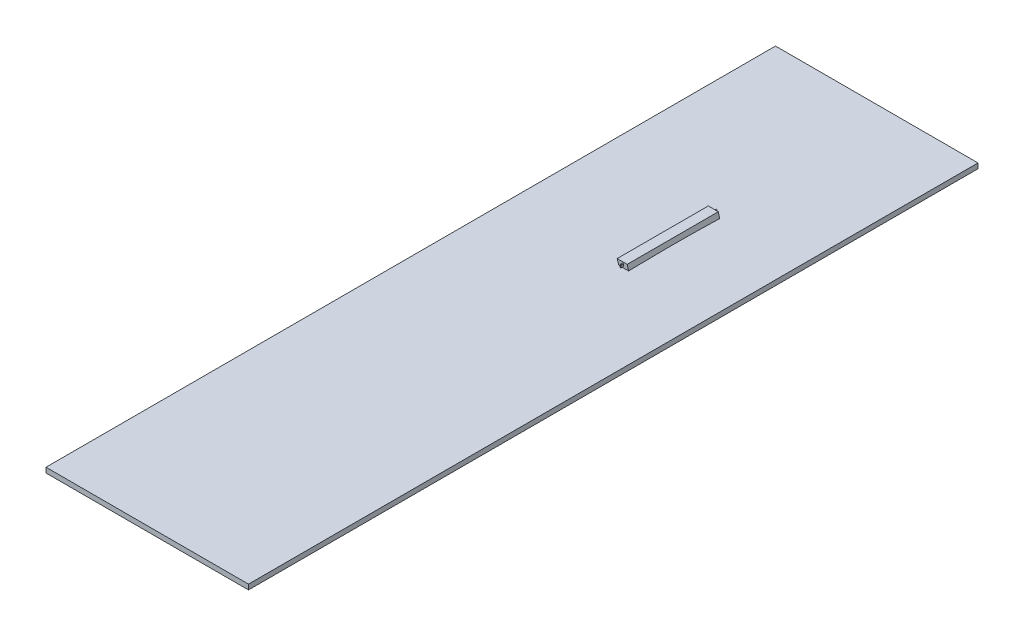
ISO-10303-21;
HEADER;
FILE_DESCRIPTION(('STEP AP214'),'2;1');
FILE_NAME('part.step','',(''),(''),'','','');
FILE_SCHEMA(('AUTOMOTIVE_DESIGN { 1 0 10303 214 1 1 1 1 }'));
ENDSEC;
DATA;
#1=APPLICATION_CONTEXT('core data for automotive mechanical design processes');
#2=APPLICATION_PROTOCOL_DEFINITION('international standard','automotive_design',2000,#1);
#3=PRODUCT_CONTEXT('',#1,'mechanical');
#4=PRODUCT('Part','Part','',(#3));
#5=PRODUCT_RELATED_PRODUCT_CATEGORY('part','',(#4));
#6=PRODUCT_DEFINITION_FORMATION('','',#4);
#7=PRODUCT_DEFINITION_CONTEXT('part definition',#1,'design');
#8=PRODUCT_DEFINITION('design','',#6,#7);
#9=PRODUCT_DEFINITION_SHAPE('','',#8);
#10=(LENGTH_UNIT() NAMED_UNIT(*) SI_UNIT(.MILLI.,.METRE.));
#11=(NAMED_UNIT(*) PLANE_ANGLE_UNIT() SI_UNIT($,.RADIAN.));
#12=(NAMED_UNIT(*) SI_UNIT($,.STERADIAN.) SOLID_ANGLE_UNIT());
#13=UNCERTAINTY_MEASURE_WITH_UNIT(LENGTH_MEASURE(1.E-05),#10,'distance_accuracy_value','');
#14=(GEOMETRIC_REPRESENTATION_CONTEXT(3) GLOBAL_UNCERTAINTY_ASSIGNED_CONTEXT((#13)) GLOBAL_UNIT_ASSIGNED_CONTEXT((#10,
#11,#12)) REPRESENTATION_CONTEXT('',''));
#15=CARTESIAN_POINT('',(0.,0.,0.));
#16=DIRECTION('',(0.,0.,1.));
#17=DIRECTION('',(1.,0.,0.));
#18=AXIS2_PLACEMENT_3D('',#15,#16,#17);
#19=CARTESIAN_POINT('',(0.,0.,-360.906787209581));
#20=DIRECTION('',(0.,0.,1.));
#21=DIRECTION('',(1.,0.,0.));
#22=AXIS2_PLACEMENT_3D('',#19,#20,#21);
#23=PLANE('',#22);
#24=DIRECTION('',(0.2647824909299,-0.964308162620724,0.));
#25=VECTOR('',#24,1.);
#26=CARTESIAN_POINT('',(38.8064860248671,394.0012038353,-360.906787209581));
#27=LINE('',#26,#25);
#28=CARTESIAN_POINT('',(54.3516519773393,337.387451299709,-360.906787209581));
#29=VERTEX_POINT('',#28);
#30=CARTESIAN_POINT('',(57.1851759921099,327.068074339287,-360.906787209581));
#31=VERTEX_POINT('',#30);
#32=EDGE_CURVE('E503',#29,#31,#27,.T.);
#33=ORIENTED_EDGE('',*,*,#32,.T.);
#34=DIRECTION('',(1.,0.,0.));
#35=VECTOR('',#34,1.);
#36=CARTESIAN_POINT('',(47.5638224982674,327.068074339287,-360.906787209581));
#37=LINE('',#36,#35);
#38=CARTESIAN_POINT('',(38.0650432552608,327.068074339287,-360.906787209581));
#39=VERTEX_POINT('',#38);
#40=EDGE_CURVE('E14',#31,#39,#37,.F.);
#41=ORIENTED_EDGE('',*,*,#40,.T.);
#42=CARTESIAN_POINT('',(79.5934517566759,140.935265317445,-360.906787209581));
#43=CARTESIAN_POINT('',(67.7143056578116,242.605545870488,-360.906787209581));
#44=CARTESIAN_POINT('',(33.8252863264388,339.461806899819,-360.906787209581));
#45=B_SPLINE_CURVE_WITH_KNOTS('',2,(#42,#43,#44),.UNSPECIFIED.,.F.,.F.,(3,3),(0.,1.),.UNSPECIFIED.);
#46=CARTESIAN_POINT('',(34.5483666432307,337.387451299709,-360.906787209581));
#47=VERTEX_POINT('',#46);
#48=EDGE_CURVE('E506',#39,#47,#45,.T.);
#49=ORIENTED_EDGE('',*,*,#48,.T.);
#50=DIRECTION('',(-1.,0.,0.));
#51=VECTOR('',#50,1.);
#52=CARTESIAN_POINT('',(0.,337.387451299709,-360.906787209581));
#53=LINE('',#52,#51);
#54=EDGE_CURVE('E511',#29,#47,#53,.T.);
#55=ORIENTED_EDGE('',*,*,#54,.F.);
#56=EDGE_LOOP('',(#33,#41,#49,#55));
#57=FACE_BOUND('',#56,.T.);
#58=DIRECTION('',(0.,1.,0.));
#59=VECTOR('',#58,1.);
#60=CARTESIAN_POINT('',(45.0654228732989,329.637204108034,-360.906787209581));
#61=LINE('',#60,#59);
#62=CARTESIAN_POINT('',(45.0654228732989,329.637204108034,-360.906787209581));
#63=VERTEX_POINT('',#62);
#64=CARTESIAN_POINT('',(45.0654228732989,334.637204108034,-360.906787209581));
#65=VERTEX_POINT('',#64);
#66=EDGE_CURVE('E454',#63,#65,#61,.T.);
#67=ORIENTED_EDGE('',*,*,#66,.F.);
#68=DIRECTION('',(-1.,0.,0.));
#69=VECTOR('',#68,1.);
#70=CARTESIAN_POINT('',(47.0654228732989,329.637204108034,-360.906787209581));
#71=LINE('',#70,#69);
#72=CARTESIAN_POINT('',(47.0654228732989,329.637204108034,-360.906787209581));
#73=VERTEX_POINT('',#72);
#74=EDGE_CURVE('E451',#73,#63,#71,.T.);
#75=ORIENTED_EDGE('',*,*,#74,.F.);
#76=DIRECTION('',(0.,-1.,0.));
#77=VECTOR('',#76,1.);
#78=CARTESIAN_POINT('',(47.0654228732989,329.637204108034,-360.906787209581));
#79=LINE('',#78,#77);
#80=CARTESIAN_POINT('',(47.0654228732989,334.637204108034,-360.906787209581));
#81=VERTEX_POINT('',#80);
#82=EDGE_CURVE('E364',#81,#73,#79,.T.);
#83=ORIENTED_EDGE('',*,*,#82,.F.);
#84=DIRECTION('',(1.,0.,0.));
#85=VECTOR('',#84,1.);
#86=CARTESIAN_POINT('',(47.0654228732989,334.637204108034,-360.906787209581));
#87=LINE('',#86,#85);
#88=EDGE_CURVE('E359',#65,#81,#87,.T.);
#89=ORIENTED_EDGE('',*,*,#88,.F.);
#90=EDGE_LOOP('',(#67,#75,#83,#89));
#91=FACE_BOUND('',#90,.T.);
#92=ADVANCED_FACE('F341',(#57,#91),#23,.F.);
#93=CARTESIAN_POINT('',(0.,0.,-180.906787209581));
#94=DIRECTION('',(0.,0.,1.));
#95=DIRECTION('',(1.,0.,0.));
#96=AXIS2_PLACEMENT_3D('',#93,#94,#95);
#97=PLANE('',#96);
#98=DIRECTION('',(-1.,0.,0.));
#99=VECTOR('',#98,1.);
#100=CARTESIAN_POINT('',(0.,337.387451299709,-180.906787209581));
#101=LINE('',#100,#99);
#102=CARTESIAN_POINT('',(54.3516519773393,337.387451299709,-180.906787209581));
#103=VERTEX_POINT('',#102);
#104=CARTESIAN_POINT('',(34.5483666432307,337.387451299709,-180.906787209581));
#105=VERTEX_POINT('',#104);
#106=EDGE_CURVE('E528',#103,#105,#101,.T.);
#107=ORIENTED_EDGE('',*,*,#106,.T.);
#108=CARTESIAN_POINT('',(79.5934517566759,140.935265317445,-180.906787209581));
#109=CARTESIAN_POINT('',(67.7143056578116,242.605545870488,-180.906787209581));
#110=CARTESIAN_POINT('',(33.8252863264388,339.461806899819,-180.906787209581));
#111=B_SPLINE_CURVE_WITH_KNOTS('',2,(#108,#109,#110),.UNSPECIFIED.,.F.,.F.,(3,3),(0.,1.),.UNSPECIFIED.);
#112=CARTESIAN_POINT('',(37.9482883061183,327.417085444205,-180.906787209581));
#113=VERTEX_POINT('',#112);
#114=EDGE_CURVE('E522',#113,#105,#111,.T.);
#115=ORIENTED_EDGE('',*,*,#114,.F.);
#116=DIRECTION('',(1.,0.,0.));
#117=VECTOR('',#116,1.);
#118=CARTESIAN_POINT('',(47.5799637548638,327.417085444205,-180.906787209581));
#119=LINE('',#118,#117);
#120=CARTESIAN_POINT('',(57.0893435255764,327.417085444205,-180.906787209581));
#121=VERTEX_POINT('',#120);
#122=EDGE_CURVE('E352',#121,#113,#119,.F.);
#123=ORIENTED_EDGE('',*,*,#122,.F.);
#124=DIRECTION('',(0.2647824909299,-0.964308162620724,0.));
#125=VECTOR('',#124,1.);
#126=CARTESIAN_POINT('',(38.8064860248671,394.0012038353,-180.906787209581));
#127=LINE('',#126,#125);
#128=EDGE_CURVE('E518',#103,#121,#127,.T.);
#129=ORIENTED_EDGE('',*,*,#128,.F.);
#130=EDGE_LOOP('',(#107,#115,#123,#129));
#131=FACE_BOUND('',#130,.T.);
#132=DIRECTION('',(-1.,0.,0.));
#133=VECTOR('',#132,1.);
#134=CARTESIAN_POINT('',(45.0105044164111,334.817497691163,-180.906787209581));
#135=LINE('',#134,#133);
#136=CARTESIAN_POINT('',(47.0105044164111,334.817497691163,-180.906787209581));
#137=VERTEX_POINT('',#136);
#138=CARTESIAN_POINT('',(45.0105044164111,334.817497691163,-180.906787209581));
#139=VERTEX_POINT('',#138);
#140=EDGE_CURVE('E461',#137,#139,#135,.T.);
#141=ORIENTED_EDGE('',*,*,#140,.F.);
#142=DIRECTION('',(0.,1.,0.));
#143=VECTOR('',#142,1.);
#144=CARTESIAN_POINT('',(47.0105044164111,329.817497691163,-180.906787209581));
#145=LINE('',#144,#143);
#146=CARTESIAN_POINT('',(47.0105044164111,329.817497691163,-180.906787209581));
#147=VERTEX_POINT('',#146);
#148=EDGE_CURVE('E456',#147,#137,#145,.T.);
#149=ORIENTED_EDGE('',*,*,#148,.F.);
#150=DIRECTION('',(1.,0.,0.));
#151=VECTOR('',#150,1.);
#152=CARTESIAN_POINT('',(45.0105044164111,329.817497691163,-180.906787209581));
#153=LINE('',#152,#151);
#154=CARTESIAN_POINT('',(45.0105044164111,329.817497691163,-180.906787209581));
#155=VERTEX_POINT('',#154);
#156=EDGE_CURVE('E472',#155,#147,#153,.T.);
#157=ORIENTED_EDGE('',*,*,#156,.F.);
#158=DIRECTION('',(0.,-1.,0.));
#159=VECTOR('',#158,1.);
#160=CARTESIAN_POINT('',(45.0105044164111,329.817497691163,-180.906787209581));
#161=LINE('',#160,#159);
#162=EDGE_CURVE('E484',#139,#155,#161,.T.);
#163=ORIENTED_EDGE('',*,*,#162,.F.);
#164=EDGE_LOOP('',(#141,#149,#157,#163));
#165=FACE_BOUND('',#164,.T.);
#166=ADVANCED_FACE('F567',(#131,#165),#97,.T.);
#167=CARTESIAN_POINT('',(79.5934517566759,140.935265317445,459.688927372495));
#168=CARTESIAN_POINT('',(67.7143056578116,242.605545870488,459.688927372495));
#169=CARTESIAN_POINT('',(33.8252863264388,339.461806899819,459.688927372495));
#170=B_SPLINE_CURVE_WITH_KNOTS('',2,(#167,#168,#169),.UNSPECIFIED.,.F.,.F.,(3,3),(0.,1.),.UNSPECIFIED.);
#171=DIRECTION('',(0.,0.,-1.));
#172=VECTOR('',#171,1.);
#173=SURFACE_OF_LINEAR_EXTRUSION('',#170,#172);
#174=ORIENTED_EDGE('',*,*,#48,.F.);
#175=CARTESIAN_POINT('',(38.5140972952893,325.721466306331,-111.234969945832));
#176=CARTESIAN_POINT('',(38.437626661458,325.951367208587,-119.164899377774));
#177=CARTESIAN_POINT('',(38.3645743574073,326.170687110974,-127.095184239526));
#178=CARTESIAN_POINT('',(38.2267521524108,326.584009234564,-142.955362789571));
#179=CARTESIAN_POINT('',(38.1619810836154,326.778015025731,-150.885256375026));
#180=CARTESIAN_POINT('',(38.0421525824308,327.136596871235,-166.744744815686));
#181=CARTESIAN_POINT('',(37.9870938716534,327.301176798786,-174.674339572648));
#182=CARTESIAN_POINT('',(37.8881338780025,327.596766004807,-190.53331168074));
#183=CARTESIAN_POINT('',(37.8442313036847,327.72777916901,-198.462688950692));
#184=CARTESIAN_POINT('',(37.7690230476383,327.952095321626,-214.321310459757));
#185=CARTESIAN_POINT('',(37.7377162010686,328.045401797122,-222.25055464333));
#186=CARTESIAN_POINT('',(37.6891335578531,328.190154295036,-238.108993683911));
#187=CARTESIAN_POINT('',(37.6718569075715,328.241602864205,-246.038188514563));
#188=CARTESIAN_POINT('',(37.6527563257277,328.298481131611,-261.897558176938));
#189=CARTESIAN_POINT('',(37.6509339286345,328.303906260133,-269.827733027796));
#190=CARTESIAN_POINT('',(37.664152833935,328.264545048095,-285.688040418021));
#191=CARTESIAN_POINT('',(37.6791943205655,328.219758158973,-293.61817295598));
#192=CARTESIAN_POINT('',(37.7275225316437,328.07578070229,-309.47831828599));
#193=CARTESIAN_POINT('',(37.760810219339,327.976587262516,-317.408331049614));
#194=CARTESIAN_POINT('',(37.8469786262215,327.719588381993,-333.268157082847));
#195=CARTESIAN_POINT('',(37.8998614364754,327.561776685872,-341.197970240804));
#196=CARTESIAN_POINT('',(38.026532302006,327.183313725697,-357.057325602944));
#197=CARTESIAN_POINT('',(38.1003239869242,326.962651551184,-364.986867520805));
#198=CARTESIAN_POINT('',(38.2700568601046,326.454241506788,-380.845577828932));
#199=CARTESIAN_POINT('',(38.3660036824556,326.166476572376,-388.774745610173));
#200=CARTESIAN_POINT('',(38.4736337559906,325.843086245644,-396.702344949578));
#201=B_SPLINE_CURVE_WITH_KNOTS('',3,(#175,#176,#177,#178,#179,#180,#181,#182,#183,#184,#185,
#186,#187,#188,#189,#190,#191,#192,#193,#194,#195,#196,#197,#198,#199,#200),.UNSPECIFIED.,.F.,
.F.,(4,2,2,2,2,2,2,2,2,2,2,2,4),(0.,23.8009053738766,47.5984505479361,71.3928610314598,
95.184515796958,118.973969826648,142.761976331963,166.552344745917,190.34297307063,
214.134857463656,237.929281506792,261.727838636703,285.532454457821),.UNSPECIFIED.);
#202=EDGE_CURVE('E551',#113,#39,#201,.T.);
#203=ORIENTED_EDGE('',*,*,#202,.F.);
#204=ORIENTED_EDGE('',*,*,#114,.T.);
#205=DIRECTION('',(0.,0.,-1.));
#206=VECTOR('',#205,1.);
#207=CARTESIAN_POINT('',(34.5483666432307,337.387451299709,-75.3342967017252));
#208=LINE('',#207,#206);
#209=EDGE_CURVE('E539',#47,#105,#208,.F.);
#210=ORIENTED_EDGE('',*,*,#209,.F.);
#211=EDGE_LOOP('',(#174,#203,#204,#210));
#212=FACE_BOUND('',#211,.T.);
#213=ADVANCED_FACE('F563',(#212),#173,.T.);
#214=CARTESIAN_POINT('',(38.8064860248671,394.0012038353,482.120102696812));
#215=DIRECTION('',(0.964308162620724,0.2647824909299,0.));
#216=DIRECTION('',(-0.2647824909299,0.964308162620724,0.));
#217=AXIS2_PLACEMENT_3D('',#214,#215,#216);
#218=PLANE('',#217);
#219=ORIENTED_EDGE('',*,*,#32,.F.);
#220=DIRECTION('',(0.,0.,-1.));
#221=VECTOR('',#220,1.);
#222=CARTESIAN_POINT('',(54.3516519773393,337.387451299709,482.120102696812));
#223=LINE('',#222,#221);
#224=EDGE_CURVE('E535',#103,#29,#223,.T.);
#225=ORIENTED_EDGE('',*,*,#224,.F.);
#226=ORIENTED_EDGE('',*,*,#128,.T.);
#227=CARTESIAN_POINT('',(57.5549314739086,325.721466306331,-111.234969945833));
#228=CARTESIAN_POINT('',(57.4918047168908,325.951366881926,-119.164887560702));
#229=CARTESIAN_POINT('',(57.4315834033685,326.170686157869,-127.09515023914));
#230=CARTESIAN_POINT('',(57.3180924152876,326.584007619594,-142.95529824084));
#231=CARTESIAN_POINT('',(57.26482179191,326.778013260868,-150.885183467583));
#232=CARTESIAN_POINT('',(57.166361339062,327.136595197473,-166.744665638109));
#233=CARTESIAN_POINT('',(57.1211704805823,327.30117524034,-174.674262489829));
#234=CARTESIAN_POINT('',(57.0400066253274,327.596764906625,-190.533246230297));
#235=CARTESIAN_POINT('',(57.0040325965398,327.727778288516,-198.462633043062));
#236=CARTESIAN_POINT('',(56.942439085988,327.952094952284,-214.321278001243));
#237=CARTESIAN_POINT('',(56.9168186782461,328.045401606468,-222.250536094717));
#238=CARTESIAN_POINT('',(56.8770720388095,328.190154413615,-238.109004323216));
#239=CARTESIAN_POINT('',(56.8629451307638,328.241603029772,-246.0382144336));
#240=CARTESIAN_POINT('',(56.8473273754259,328.298481144716,-261.897582079219));
#241=CARTESIAN_POINT('',(56.8458377413092,328.303906225253,-269.827739632332));
#242=CARTESIAN_POINT('',(56.8566456227973,328.264545131915,-285.688014236913));
#243=CARTESIAN_POINT('',(56.8689432846305,328.219758425494,-293.61813128706));
#244=CARTESIAN_POINT('',(56.9084768981074,328.075781435022,-309.478249928888));
#245=CARTESIAN_POINT('',(56.9357136125221,327.976588373046,-317.408251493996));
#246=CARTESIAN_POINT('',(57.006280931187,327.719590105661,-333.268061738919));
#247=CARTESIAN_POINT('',(57.0496131963937,327.561778851235,-341.197870314332));
#248=CARTESIAN_POINT('',(57.1535325133596,327.183316343188,-357.05722511917));
#249=CARTESIAN_POINT('',(57.214122463392,326.962654534381,-364.986771080593));
#250=CARTESIAN_POINT('',(57.3537232515783,326.454244106322,-380.845500157229));
#251=CARTESIAN_POINT('',(57.4327386265696,326.166478964416,-388.774682701237));
#252=CARTESIAN_POINT('',(57.5215367234271,325.843086245644,-396.702344949578));
#253=B_SPLINE_CURVE_WITH_KNOTS('',3,(#227,#228,#229,#230,#231,#232,#233,#234,#235,#236,#237,
#238,#239,#240,#241,#242,#243,#244,#245,#246,#247,#248,#249,#250,#251,#252),.UNSPECIFIED.,.F.,
.F.,(4,2,2,2,2,2,2,2,2,2,2,2,4),(0.,23.8005171082993,47.5977818689919,71.3920137348638,
95.183580185069,118.973018361819,142.761056514682,166.551378288316,190.341952384985,
214.133741314139,237.927986083973,261.726229241878,285.530338369131),.UNSPECIFIED.);
#254=EDGE_CURVE('E542',#121,#31,#253,.T.);
#255=ORIENTED_EDGE('',*,*,#254,.T.);
#256=EDGE_LOOP('',(#219,#225,#226,#255));
#257=FACE_BOUND('',#256,.T.);
#258=ADVANCED_FACE('F561',(#257),#218,.T.);
#259=CARTESIAN_POINT('',(0.,337.387451299709,0.));
#260=DIRECTION('',(0.,-1.,0.));
#261=DIRECTION('',(0.,0.,-1.));
#262=AXIS2_PLACEMENT_3D('',#259,#260,#261);
#263=PLANE('',#262);
#264=ORIENTED_EDGE('',*,*,#224,.T.);
#265=ORIENTED_EDGE('',*,*,#54,.T.);
#266=ORIENTED_EDGE('',*,*,#209,.T.);
#267=ORIENTED_EDGE('',*,*,#106,.F.);
#268=EDGE_LOOP('',(#264,#265,#266,#267));
#269=FACE_BOUND('',#268,.T.);
#270=ADVANCED_FACE('F559',(#269),#263,.F.);
#271=CARTESIAN_POINT('',(-321.200733720247,120.735265523539,412.255506908933));
#272=CARTESIAN_POINT('',(-321.200733720247,184.28998488035,347.945615604378));
#273=CARTESIAN_POINT('',(-321.200733720247,260.118965510706,243.198199319056));
#274=CARTESIAN_POINT('',(-321.200733720247,315.383822661597,107.441933730423));
#275=CARTESIAN_POINT('',(-321.200733720247,321.489904749579,13.0570049985076));
#276=CARTESIAN_POINT('',(-321.200733720247,324.056750228038,-55.482106564492));
#277=CARTESIAN_POINT('',(-321.200733720247,329.770066062198,-245.254817305456));
#278=CARTESIAN_POINT('',(-321.200733720247,330.105519590004,-395.293106061705));
#279=CARTESIAN_POINT('',(-321.200733720247,316.677995768092,-529.808763742509));
#280=B_SPLINE_CURVE_WITH_KNOTS('',3,(#271,#272,#273,#274,#275,#276,#277,#278,#279),
.UNSPECIFIED.,.F.,.F.,(4,1,1,1,1,1,4),(0.,0.268354736053871,0.388679730465141,0.430559092744216,
0.551186882643778,0.59467935564418,1.),.UNSPECIFIED.);
#281=DIRECTION('',(1.,0.,0.));
#282=VECTOR('',#281,1.);
#283=SURFACE_OF_LINEAR_EXTRUSION('',#280,#282);
#284=ORIENTED_EDGE('',*,*,#40,.F.);
#285=ORIENTED_EDGE('',*,*,#254,.F.);
#286=ORIENTED_EDGE('',*,*,#122,.T.);
#287=ORIENTED_EDGE('',*,*,#202,.T.);
#288=EDGE_LOOP('',(#284,#285,#286,#287));
#289=FACE_BOUND('',#288,.T.);
#290=ADVANCED_FACE('F343',(#289),#283,.T.);
#291=CARTESIAN_POINT('',(47.0105044164111,329.817497691163,-175.906787209581));
#292=DIRECTION('',(-1.,0.,0.));
#293=DIRECTION('',(0.,0.,1.));
#294=AXIS2_PLACEMENT_3D('',#291,#292,#293);
#295=PLANE('',#294);
#296=ORIENTED_EDGE('',*,*,#148,.T.);
#297=DIRECTION('',(0.,0.,-1.));
#298=VECTOR('',#297,1.);
#299=CARTESIAN_POINT('',(47.0105044164111,334.817497691163,-175.906787209581));
#300=LINE('',#299,#298);
#301=CARTESIAN_POINT('',(47.0105044164111,334.817497691163,-175.906787209581));
#302=VERTEX_POINT('',#301);
#303=EDGE_CURVE('E500',#302,#137,#300,.T.);
#304=ORIENTED_EDGE('',*,*,#303,.F.);
#305=DIRECTION('',(0.,1.,0.));
#306=VECTOR('',#305,1.);
#307=CARTESIAN_POINT('',(47.0105044164111,329.817497691163,-175.906787209581));
#308=LINE('',#307,#306);
#309=CARTESIAN_POINT('',(47.0105044164111,329.817497691163,-175.906787209581));
#310=VERTEX_POINT('',#309);
#311=EDGE_CURVE('E467',#310,#302,#308,.T.);
#312=ORIENTED_EDGE('',*,*,#311,.F.);
#313=DIRECTION('',(0.,0.,-1.));
#314=VECTOR('',#313,1.);
#315=CARTESIAN_POINT('',(47.0105044164111,329.817497691163,-175.906787209581));
#316=LINE('',#315,#314);
#317=EDGE_CURVE('E480',#310,#147,#316,.T.);
#318=ORIENTED_EDGE('',*,*,#317,.T.);
#319=EDGE_LOOP('',(#296,#304,#312,#318));
#320=FACE_BOUND('',#319,.T.);
#321=ADVANCED_FACE('F615',(#320),#295,.F.);
#322=CARTESIAN_POINT('',(45.0105044164111,334.817497691163,-175.906787209581));
#323=DIRECTION('',(0.,-1.,0.));
#324=DIRECTION('',(0.,0.,-1.));
#325=AXIS2_PLACEMENT_3D('',#322,#323,#324);
#326=PLANE('',#325);
#327=ORIENTED_EDGE('',*,*,#140,.T.);
#328=DIRECTION('',(0.,0.,-1.));
#329=VECTOR('',#328,1.);
#330=CARTESIAN_POINT('',(45.0105044164111,334.817497691163,-175.906787209581));
#331=LINE('',#330,#329);
#332=CARTESIAN_POINT('',(45.0105044164111,334.817497691163,-175.906787209581));
#333=VERTEX_POINT('',#332);
#334=EDGE_CURVE('E496',#333,#139,#331,.T.);
#335=ORIENTED_EDGE('',*,*,#334,.F.);
#336=DIRECTION('',(-1.,0.,0.));
#337=VECTOR('',#336,1.);
#338=CARTESIAN_POINT('',(45.0105044164111,334.817497691163,-175.906787209581));
#339=LINE('',#338,#337);
#340=EDGE_CURVE('E471',#302,#333,#339,.T.);
#341=ORIENTED_EDGE('',*,*,#340,.F.);
#342=ORIENTED_EDGE('',*,*,#303,.T.);
#343=EDGE_LOOP('',(#327,#335,#341,#342));
#344=FACE_BOUND('',#343,.T.);
#345=ADVANCED_FACE('F603',(#344),#326,.F.);
#346=CARTESIAN_POINT('',(45.0105044164111,329.817497691163,-175.906787209581));
#347=DIRECTION('',(1.,0.,0.));
#348=DIRECTION('',(0.,0.,-1.));
#349=AXIS2_PLACEMENT_3D('',#346,#347,#348);
#350=PLANE('',#349);
#351=ORIENTED_EDGE('',*,*,#162,.T.);
#352=DIRECTION('',(0.,0.,-1.));
#353=VECTOR('',#352,1.);
#354=CARTESIAN_POINT('',(45.0105044164111,329.817497691163,-175.906787209581));
#355=LINE('',#354,#353);
#356=CARTESIAN_POINT('',(45.0105044164111,329.817497691163,-175.906787209581));
#357=VERTEX_POINT('',#356);
#358=EDGE_CURVE('E493',#357,#155,#355,.T.);
#359=ORIENTED_EDGE('',*,*,#358,.F.);
#360=DIRECTION('',(0.,-1.,0.));
#361=VECTOR('',#360,1.);
#362=CARTESIAN_POINT('',(45.0105044164111,329.817497691163,-175.906787209581));
#363=LINE('',#362,#361);
#364=EDGE_CURVE('E475',#333,#357,#363,.T.);
#365=ORIENTED_EDGE('',*,*,#364,.F.);
#366=ORIENTED_EDGE('',*,*,#334,.T.);
#367=EDGE_LOOP('',(#351,#359,#365,#366));
#368=FACE_BOUND('',#367,.T.);
#369=ADVANCED_FACE('F607',(#368),#350,.F.);
#370=CARTESIAN_POINT('',(45.0105044164111,329.817497691163,-175.906787209581));
#371=DIRECTION('',(0.,1.,0.));
#372=DIRECTION('',(0.,0.,1.));
#373=AXIS2_PLACEMENT_3D('',#370,#371,#372);
#374=PLANE('',#373);
#375=ORIENTED_EDGE('',*,*,#156,.T.);
#376=ORIENTED_EDGE('',*,*,#317,.F.);
#377=DIRECTION('',(1.,0.,0.));
#378=VECTOR('',#377,1.);
#379=CARTESIAN_POINT('',(45.0105044164111,329.817497691163,-175.906787209581));
#380=LINE('',#379,#378);
#381=EDGE_CURVE('E478',#357,#310,#380,.T.);
#382=ORIENTED_EDGE('',*,*,#381,.F.);
#383=ORIENTED_EDGE('',*,*,#358,.T.);
#384=EDGE_LOOP('',(#375,#376,#382,#383));
#385=FACE_BOUND('',#384,.T.);
#386=ADVANCED_FACE('F617',(#385),#374,.F.);
#387=CARTESIAN_POINT('',(0.,0.,-175.906787209581));
#388=DIRECTION('',(0.,0.,-1.));
#389=DIRECTION('',(-1.,0.,0.));
#390=AXIS2_PLACEMENT_3D('',#387,#388,#389);
#391=PLANE('',#390);
#392=ORIENTED_EDGE('',*,*,#311,.T.);
#393=ORIENTED_EDGE('',*,*,#340,.T.);
#394=ORIENTED_EDGE('',*,*,#364,.T.);
#395=ORIENTED_EDGE('',*,*,#381,.T.);
#396=EDGE_LOOP('',(#392,#393,#394,#395));
#397=FACE_BOUND('',#396,.T.);
#398=ADVANCED_FACE('F611',(#397),#391,.F.);
#399=CARTESIAN_POINT('',(45.0654228732989,329.637204108034,-365.906787209581));
#400=DIRECTION('',(1.,0.,0.));
#401=DIRECTION('',(0.,0.,-1.));
#402=AXIS2_PLACEMENT_3D('',#399,#400,#401);
#403=PLANE('',#402);
#404=ORIENTED_EDGE('',*,*,#66,.T.);
#405=DIRECTION('',(0.,0.,1.));
#406=VECTOR('',#405,1.);
#407=CARTESIAN_POINT('',(45.0654228732989,334.637204108034,-365.906787209581));
#408=LINE('',#407,#406);
#409=CARTESIAN_POINT('',(45.0654228732989,334.637204108034,-365.906787209581));
#410=VERTEX_POINT('',#409);
#411=EDGE_CURVE('E433',#410,#65,#408,.T.);
#412=ORIENTED_EDGE('',*,*,#411,.F.);
#413=DIRECTION('',(0.,1.,0.));
#414=VECTOR('',#413,1.);
#415=CARTESIAN_POINT('',(45.0654228732989,329.637204108034,-365.906787209581));
#416=LINE('',#415,#414);
#417=CARTESIAN_POINT('',(45.0654228732989,329.637204108034,-365.906787209581));
#418=VERTEX_POINT('',#417);
#419=EDGE_CURVE('E441',#418,#410,#416,.T.);
#420=ORIENTED_EDGE('',*,*,#419,.F.);
#421=DIRECTION('',(0.,0.,1.));
#422=VECTOR('',#421,1.);
#423=CARTESIAN_POINT('',(45.0654228732989,329.637204108034,-365.906787209581));
#424=LINE('',#423,#422);
#425=EDGE_CURVE('E708',#418,#63,#424,.T.);
#426=ORIENTED_EDGE('',*,*,#425,.T.);
#427=EDGE_LOOP('',(#404,#412,#420,#426));
#428=FACE_BOUND('',#427,.T.);
#429=ADVANCED_FACE('F453',(#428),#403,.F.);
#430=CARTESIAN_POINT('',(47.0654228732989,334.637204108034,-365.906787209581));
#431=DIRECTION('',(0.,-1.,0.));
#432=DIRECTION('',(0.,0.,-1.));
#433=AXIS2_PLACEMENT_3D('',#430,#431,#432);
#434=PLANE('',#433);
#435=ORIENTED_EDGE('',*,*,#88,.T.);
#436=DIRECTION('',(0.,0.,1.));
#437=VECTOR('',#436,1.);
#438=CARTESIAN_POINT('',(47.0654228732989,334.637204108034,-365.906787209581));
#439=LINE('',#438,#437);
#440=CARTESIAN_POINT('',(47.0654228732989,334.637204108034,-365.906787209581));
#441=VERTEX_POINT('',#440);
#442=EDGE_CURVE('E436',#441,#81,#439,.T.);
#443=ORIENTED_EDGE('',*,*,#442,.F.);
#444=DIRECTION('',(1.,0.,0.));
#445=VECTOR('',#444,1.);
#446=CARTESIAN_POINT('',(47.0654228732989,334.637204108034,-365.906787209581));
#447=LINE('',#446,#445);
#448=EDGE_CURVE('E429',#410,#441,#447,.T.);
#449=ORIENTED_EDGE('',*,*,#448,.F.);
#450=ORIENTED_EDGE('',*,*,#411,.T.);
#451=EDGE_LOOP('',(#435,#443,#449,#450));
#452=FACE_BOUND('',#451,.T.);
#453=ADVANCED_FACE('F431',(#452),#434,.F.);
#454=CARTESIAN_POINT('',(47.0654228732989,329.637204108034,-365.906787209581));
#455=DIRECTION('',(-1.,0.,0.));
#456=DIRECTION('',(0.,0.,1.));
#457=AXIS2_PLACEMENT_3D('',#454,#455,#456);
#458=PLANE('',#457);
#459=ORIENTED_EDGE('',*,*,#82,.T.);
#460=DIRECTION('',(0.,0.,1.));
#461=VECTOR('',#460,1.);
#462=CARTESIAN_POINT('',(47.0654228732989,329.637204108034,-365.906787209581));
#463=LINE('',#462,#461);
#464=CARTESIAN_POINT('',(47.0654228732989,329.637204108034,-365.906787209581));
#465=VERTEX_POINT('',#464);
#466=EDGE_CURVE('E463',#465,#73,#463,.T.);
#467=ORIENTED_EDGE('',*,*,#466,.F.);
#468=DIRECTION('',(0.,-1.,0.));
#469=VECTOR('',#468,1.);
#470=CARTESIAN_POINT('',(47.0654228732989,329.637204108034,-365.906787209581));
#471=LINE('',#470,#469);
#472=EDGE_CURVE('E440',#441,#465,#471,.T.);
#473=ORIENTED_EDGE('',*,*,#472,.F.);
#474=ORIENTED_EDGE('',*,*,#442,.T.);
#475=EDGE_LOOP('',(#459,#467,#473,#474));
#476=FACE_BOUND('',#475,.T.);
#477=ADVANCED_FACE('F675',(#476),#458,.F.);
#478=CARTESIAN_POINT('',(47.0654228732989,329.637204108034,-365.906787209581));
#479=DIRECTION('',(0.,1.,0.));
#480=DIRECTION('',(0.,0.,1.));
#481=AXIS2_PLACEMENT_3D('',#478,#479,#480);
#482=PLANE('',#481);
#483=ORIENTED_EDGE('',*,*,#74,.T.);
#484=ORIENTED_EDGE('',*,*,#425,.F.);
#485=DIRECTION('',(-1.,0.,0.));
#486=VECTOR('',#485,1.);
#487=CARTESIAN_POINT('',(47.0654228732989,329.637204108034,-365.906787209581));
#488=LINE('',#487,#486);
#489=EDGE_CURVE('E446',#465,#418,#488,.T.);
#490=ORIENTED_EDGE('',*,*,#489,.F.);
#491=ORIENTED_EDGE('',*,*,#466,.T.);
#492=EDGE_LOOP('',(#483,#484,#490,#491));
#493=FACE_BOUND('',#492,.T.);
#494=ADVANCED_FACE('F684',(#493),#482,.F.);
#495=CARTESIAN_POINT('',(0.,0.,-365.906787209581));
#496=DIRECTION('',(0.,0.,1.));
#497=DIRECTION('',(1.,0.,0.));
#498=AXIS2_PLACEMENT_3D('',#495,#496,#497);
#499=PLANE('',#498);
#500=ORIENTED_EDGE('',*,*,#419,.T.);
#501=ORIENTED_EDGE('',*,*,#448,.T.);
#502=ORIENTED_EDGE('',*,*,#472,.T.);
#503=ORIENTED_EDGE('',*,*,#489,.T.);
#504=EDGE_LOOP('',(#500,#501,#502,#503));
#505=FACE_BOUND('',#504,.T.);
#506=ADVANCED_FACE('F444',(#505),#499,.F.);
#507=CLOSED_SHELL('',(#92,#166,#213,#258,#270,#290,#321,#345,#369,#386,#398,#429,#453,#477,#494,#506));
#508=MANIFOLD_SOLID_BREP('B2',#507);
#509=CARTESIAN_POINT('',(-200.,310.,712.77097818594));
#510=DIRECTION('',(1.,0.,0.));
#511=DIRECTION('',(0.,0.,-1.));
#512=AXIS2_PLACEMENT_3D('',#509,#510,#511);
#513=PLANE('',#512);
#514=DIRECTION('',(0.,0.,1.));
#515=VECTOR('',#514,1.);
#516=CARTESIAN_POINT('',(-200.,300.,712.77097818594));
#517=LINE('',#516,#515);
#518=CARTESIAN_POINT('',(-200.,300.,-728.257150163641));
#519=VERTEX_POINT('',#518);
#520=CARTESIAN_POINT('',(-200.,300.,712.77097818594));
#521=VERTEX_POINT('',#520);
#522=EDGE_CURVE('E848',#519,#521,#517,.T.);
#523=ORIENTED_EDGE('',*,*,#522,.T.);
#524=DIRECTION('',(0.,-1.,0.));
#525=VECTOR('',#524,1.);
#526=CARTESIAN_POINT('',(-200.,310.,712.77097818594));
#527=LINE('',#526,#525);
#528=CARTESIAN_POINT('',(-200.,310.,712.77097818594));
#529=VERTEX_POINT('',#528);
#530=EDGE_CURVE('E339',#529,#521,#527,.T.);
#531=ORIENTED_EDGE('',*,*,#530,.F.);
#532=DIRECTION('',(0.,0.,1.));
#533=VECTOR('',#532,1.);
#534=CARTESIAN_POINT('',(-200.,310.,712.77097818594));
#535=LINE('',#534,#533);
#536=CARTESIAN_POINT('',(-200.,310.,-728.257150163641));
#537=VERTEX_POINT('',#536);
#538=EDGE_CURVE('E836',#537,#529,#535,.T.);
#539=ORIENTED_EDGE('',*,*,#538,.F.);
#540=DIRECTION('',(0.,-1.,0.));
#541=VECTOR('',#540,1.);
#542=CARTESIAN_POINT('',(-200.,310.,-728.257150163641));
#543=LINE('',#542,#541);
#544=EDGE_CURVE('E844',#537,#519,#543,.T.);
#545=ORIENTED_EDGE('',*,*,#544,.T.);
#546=EDGE_LOOP('',(#523,#531,#539,#545));
#547=FACE_BOUND('',#546,.T.);
#548=ADVANCED_FACE('F785',(#547),#513,.F.);
#549=CARTESIAN_POINT('',(-200.,310.,712.77097818594));
#550=DIRECTION('',(0.,0.,-1.));
#551=DIRECTION('',(-1.,0.,0.));
#552=AXIS2_PLACEMENT_3D('',#549,#550,#551);
#553=PLANE('',#552);
#554=DIRECTION('',(1.,0.,0.));
#555=VECTOR('',#554,1.);
#556=CARTESIAN_POINT('',(-200.,300.,712.77097818594));
#557=LINE('',#556,#555);
#558=CARTESIAN_POINT('',(200.,300.,712.77097818594));
#559=VERTEX_POINT('',#558);
#560=EDGE_CURVE('E840',#521,#559,#557,.T.);
#561=ORIENTED_EDGE('',*,*,#560,.T.);
#562=DIRECTION('',(0.,-1.,0.));
#563=VECTOR('',#562,1.);
#564=CARTESIAN_POINT('',(200.,310.,712.77097818594));
#565=LINE('',#564,#563);
#566=CARTESIAN_POINT('',(200.,310.,712.77097818594));
#567=VERTEX_POINT('',#566);
#568=EDGE_CURVE('E793',#567,#559,#565,.T.);
#569=ORIENTED_EDGE('',*,*,#568,.F.);
#570=DIRECTION('',(1.,0.,0.));
#571=VECTOR('',#570,1.);
#572=CARTESIAN_POINT('',(-200.,310.,712.77097818594));
#573=LINE('',#572,#571);
#574=EDGE_CURVE('E831',#529,#567,#573,.T.);
#575=ORIENTED_EDGE('',*,*,#574,.F.);
#576=ORIENTED_EDGE('',*,*,#530,.T.);
#577=EDGE_LOOP('',(#561,#569,#575,#576));
#578=FACE_BOUND('',#577,.T.);
#579=ADVANCED_FACE('F839',(#578),#553,.F.);
#580=CARTESIAN_POINT('',(200.,310.,712.77097818594));
#581=DIRECTION('',(-1.,0.,0.));
#582=DIRECTION('',(0.,0.,1.));
#583=AXIS2_PLACEMENT_3D('',#580,#581,#582);
#584=PLANE('',#583);
#585=DIRECTION('',(0.,0.,-1.));
#586=VECTOR('',#585,1.);
#587=CARTESIAN_POINT('',(200.,300.,712.77097818594));
#588=LINE('',#587,#586);
#589=CARTESIAN_POINT('',(200.,300.,-728.257150163641));
#590=VERTEX_POINT('',#589);
#591=EDGE_CURVE('E818',#559,#590,#588,.T.);
#592=ORIENTED_EDGE('',*,*,#591,.T.);
#593=DIRECTION('',(0.,-1.,0.));
#594=VECTOR('',#593,1.);
#595=CARTESIAN_POINT('',(200.,310.,-728.257150163641));
#596=LINE('',#595,#594);
#597=CARTESIAN_POINT('',(200.,310.,-728.257150163641));
#598=VERTEX_POINT('',#597);
#599=EDGE_CURVE('E841',#598,#590,#596,.T.);
#600=ORIENTED_EDGE('',*,*,#599,.F.);
#601=DIRECTION('',(0.,0.,-1.));
#602=VECTOR('',#601,1.);
#603=CARTESIAN_POINT('',(200.,310.,712.77097818594));
#604=LINE('',#603,#602);
#605=EDGE_CURVE('E834',#567,#598,#604,.T.);
#606=ORIENTED_EDGE('',*,*,#605,.F.);
#607=ORIENTED_EDGE('',*,*,#568,.T.);
#608=EDGE_LOOP('',(#592,#600,#606,#607));
#609=FACE_BOUND('',#608,.T.);
#610=ADVANCED_FACE('F842',(#609),#584,.F.);
#611=CARTESIAN_POINT('',(-200.,310.,-728.257150163641));
#612=DIRECTION('',(0.,0.,1.));
#613=DIRECTION('',(1.,0.,0.));
#614=AXIS2_PLACEMENT_3D('',#611,#612,#613);
#615=PLANE('',#614);
#616=DIRECTION('',(-1.,0.,0.));
#617=VECTOR('',#616,1.);
#618=CARTESIAN_POINT('',(-200.,300.,-728.257150163641));
#619=LINE('',#618,#617);
#620=EDGE_CURVE('E824',#590,#519,#619,.T.);
#621=ORIENTED_EDGE('',*,*,#620,.T.);
#622=ORIENTED_EDGE('',*,*,#544,.F.);
#623=DIRECTION('',(-1.,0.,0.));
#624=VECTOR('',#623,1.);
#625=CARTESIAN_POINT('',(-200.,310.,-728.257150163641));
#626=LINE('',#625,#624);
#627=EDGE_CURVE('E801',#598,#537,#626,.T.);
#628=ORIENTED_EDGE('',*,*,#627,.F.);
#629=ORIENTED_EDGE('',*,*,#599,.T.);
#630=EDGE_LOOP('',(#621,#622,#628,#629));
#631=FACE_BOUND('',#630,.T.);
#632=ADVANCED_FACE('F855',(#631),#615,.F.);
#633=CARTESIAN_POINT('',(0.,310.,0.));
#634=DIRECTION('',(0.,-1.,0.));
#635=DIRECTION('',(0.,0.,-1.));
#636=AXIS2_PLACEMENT_3D('',#633,#634,#635);
#637=PLANE('',#636);
#638=ORIENTED_EDGE('',*,*,#538,.T.);
#639=ORIENTED_EDGE('',*,*,#574,.T.);
#640=ORIENTED_EDGE('',*,*,#605,.T.);
#641=ORIENTED_EDGE('',*,*,#627,.T.);
#642=EDGE_LOOP('',(#638,#639,#640,#641));
#643=FACE_BOUND('',#642,.T.);
#644=ADVANCED_FACE('F832',(#643),#637,.F.);
#645=CARTESIAN_POINT('',(0.,300.,0.));
#646=DIRECTION('',(0.,-1.,0.));
#647=DIRECTION('',(0.,0.,-1.));
#648=AXIS2_PLACEMENT_3D('',#645,#646,#647);
#649=PLANE('',#648);
#650=ORIENTED_EDGE('',*,*,#522,.F.);
#651=ORIENTED_EDGE('',*,*,#620,.F.);
#652=ORIENTED_EDGE('',*,*,#591,.F.);
#653=ORIENTED_EDGE('',*,*,#560,.F.);
#654=EDGE_LOOP('',(#650,#651,#652,#653));
#655=FACE_BOUND('',#654,.T.);
#656=ADVANCED_FACE('F858',(#655),#649,.T.);
#657=CLOSED_SHELL('',(#548,#579,#610,#632,#644,#656));
#658=MANIFOLD_SOLID_BREP('B8_NOT_SHOWN',#657);
#659=ADVANCED_BREP_SHAPE_REPRESENTATION('',(#18,#508,#658),#14);
#660=SHAPE_DEFINITION_REPRESENTATION(#9,#659);
ENDSEC;
END-ISO-10303-21;
